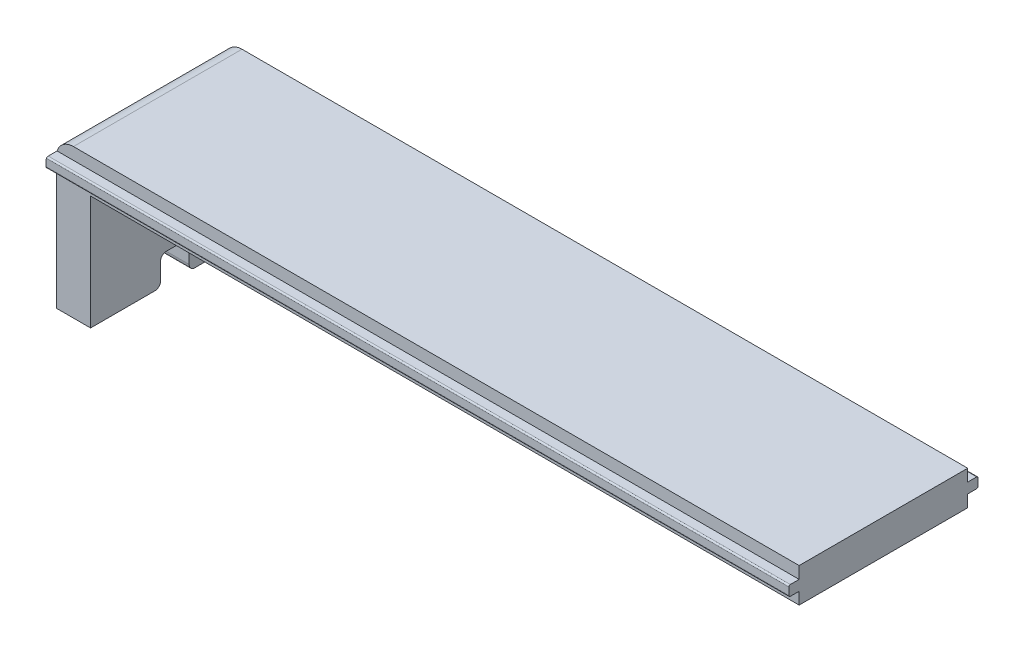
ISO-10303-21;
HEADER;
FILE_DESCRIPTION(('STEP AP214'),'2;1');
FILE_NAME('part.step','',(''),(''),'','','');
FILE_SCHEMA(('AUTOMOTIVE_DESIGN { 1 0 10303 214 1 1 1 1 }'));
ENDSEC;
DATA;
#1=APPLICATION_CONTEXT('core data for automotive mechanical design processes');
#2=APPLICATION_PROTOCOL_DEFINITION('international standard','automotive_design',2000,#1);
#3=PRODUCT_CONTEXT('',#1,'mechanical');
#4=PRODUCT('Part','Part','',(#3));
#5=PRODUCT_RELATED_PRODUCT_CATEGORY('part','',(#4));
#6=PRODUCT_DEFINITION_FORMATION('','',#4);
#7=PRODUCT_DEFINITION_CONTEXT('part definition',#1,'design');
#8=PRODUCT_DEFINITION('design','',#6,#7);
#9=PRODUCT_DEFINITION_SHAPE('','',#8);
#10=(LENGTH_UNIT() NAMED_UNIT(*) SI_UNIT(.MILLI.,.METRE.));
#11=(NAMED_UNIT(*) PLANE_ANGLE_UNIT() SI_UNIT($,.RADIAN.));
#12=(NAMED_UNIT(*) SI_UNIT($,.STERADIAN.) SOLID_ANGLE_UNIT());
#13=UNCERTAINTY_MEASURE_WITH_UNIT(LENGTH_MEASURE(1.E-05),#10,'distance_accuracy_value','');
#14=(GEOMETRIC_REPRESENTATION_CONTEXT(3) GLOBAL_UNCERTAINTY_ASSIGNED_CONTEXT((#13)) GLOBAL_UNIT_ASSIGNED_CONTEXT((#10,
#11,#12)) REPRESENTATION_CONTEXT('',''));
#15=CARTESIAN_POINT('',(0.,0.,0.));
#16=DIRECTION('',(0.,0.,1.));
#17=DIRECTION('',(1.,0.,0.));
#18=AXIS2_PLACEMENT_3D('',#15,#16,#17);
#19=CARTESIAN_POINT('',(0.,0.,29.5));
#20=DIRECTION('',(0.,0.,-1.));
#21=DIRECTION('',(-1.,0.,0.));
#22=AXIS2_PLACEMENT_3D('',#19,#20,#21);
#23=PLANE('',#22);
#24=DIRECTION('',(-1.,0.,0.));
#25=VECTOR('',#24,1.);
#26=CARTESIAN_POINT('',(0.,26.,29.5));
#27=LINE('',#26,#25);
#28=CARTESIAN_POINT('',(130.,26.,29.5));
#29=VERTEX_POINT('',#28);
#30=CARTESIAN_POINT('',(3.,26.,29.5));
#31=VERTEX_POINT('',#30);
#32=EDGE_CURVE('E321',#29,#31,#27,.T.);
#33=ORIENTED_EDGE('',*,*,#32,.T.);
#34=CARTESIAN_POINT('',(3.,23.,29.5));
#35=DIRECTION('',(0.,0.,-1.));
#36=DIRECTION('',(-1.,0.,0.));
#37=AXIS2_PLACEMENT_3D('',#34,#35,#36);
#38=CIRCLE('',#37,3.);
#39=CARTESIAN_POINT('',(0.13818239574917,23.9,29.5));
#40=VERTEX_POINT('',#39);
#41=EDGE_CURVE('E381',#31,#40,#38,.F.);
#42=ORIENTED_EDGE('',*,*,#41,.T.);
#43=DIRECTION('',(-1.,0.,0.));
#44=VECTOR('',#43,1.);
#45=CARTESIAN_POINT('',(132.545584412272,23.9,29.5));
#46=LINE('',#45,#44);
#47=CARTESIAN_POINT('',(130.,23.9,29.5));
#48=VERTEX_POINT('',#47);
#49=EDGE_CURVE('E622',#48,#40,#46,.T.);
#50=ORIENTED_EDGE('',*,*,#49,.F.);
#51=DIRECTION('',(0.,1.,0.));
#52=VECTOR('',#51,1.);
#53=CARTESIAN_POINT('',(130.,26.,29.5));
#54=LINE('',#53,#52);
#55=EDGE_CURVE('E316',#48,#29,#54,.T.);
#56=ORIENTED_EDGE('',*,*,#55,.T.);
#57=EDGE_LOOP('',(#33,#42,#50,#56));
#58=FACE_BOUND('',#57,.T.);
#59=ADVANCED_FACE('F53',(#58),#23,.F.);
#60=CARTESIAN_POINT('',(0.,0.,0.));
#61=DIRECTION('',(0.,0.,-1.));
#62=DIRECTION('',(-1.,0.,0.));
#63=AXIS2_PLACEMENT_3D('',#60,#61,#62);
#64=PLANE('',#63);
#65=DIRECTION('',(-1.,0.,0.));
#66=VECTOR('',#65,1.);
#67=CARTESIAN_POINT('',(132.545584412272,23.9,0.));
#68=LINE('',#67,#66);
#69=CARTESIAN_POINT('',(130.,23.9,0.));
#70=VERTEX_POINT('',#69);
#71=CARTESIAN_POINT('',(0.138182395749162,23.9,0.));
#72=VERTEX_POINT('',#71);
#73=EDGE_CURVE('E260',#70,#72,#68,.T.);
#74=ORIENTED_EDGE('',*,*,#73,.T.);
#75=CARTESIAN_POINT('',(3.,23.,0.));
#76=DIRECTION('',(0.,0.,-1.));
#77=DIRECTION('',(-1.,0.,0.));
#78=AXIS2_PLACEMENT_3D('',#75,#76,#77);
#79=CIRCLE('',#78,3.);
#80=CARTESIAN_POINT('',(3.,26.,0.));
#81=VERTEX_POINT('',#80);
#82=EDGE_CURVE('E375',#72,#81,#79,.T.);
#83=ORIENTED_EDGE('',*,*,#82,.T.);
#84=DIRECTION('',(-1.,0.,0.));
#85=VECTOR('',#84,1.);
#86=CARTESIAN_POINT('',(0.,26.,0.));
#87=LINE('',#86,#85);
#88=CARTESIAN_POINT('',(130.,26.,0.));
#89=VERTEX_POINT('',#88);
#90=EDGE_CURVE('E273',#89,#81,#87,.T.);
#91=ORIENTED_EDGE('',*,*,#90,.F.);
#92=DIRECTION('',(0.,1.,0.));
#93=VECTOR('',#92,1.);
#94=CARTESIAN_POINT('',(130.,26.,0.));
#95=LINE('',#94,#93);
#96=EDGE_CURVE('E337',#70,#89,#95,.T.);
#97=ORIENTED_EDGE('',*,*,#96,.F.);
#98=EDGE_LOOP('',(#74,#83,#91,#97));
#99=FACE_BOUND('',#98,.T.);
#100=ADVANCED_FACE('F587',(#99),#64,.T.);
#101=CARTESIAN_POINT('',(6.,0.,29.5));
#102=DIRECTION('',(0.,1.,0.));
#103=DIRECTION('',(-1.,0.,0.));
#104=AXIS2_PLACEMENT_3D('',#101,#102,#103);
#105=PLANE('',#104);
#106=DIRECTION('',(0.,0.,-1.));
#107=VECTOR('',#106,1.);
#108=CARTESIAN_POINT('',(0.,0.,29.5));
#109=LINE('',#108,#107);
#110=CARTESIAN_POINT('',(0.,0.,29.5));
#111=VERTEX_POINT('',#110);
#112=CARTESIAN_POINT('',(0.,0.,18.25));
#113=VERTEX_POINT('',#112);
#114=EDGE_CURVE('E344',#111,#113,#109,.T.);
#115=ORIENTED_EDGE('',*,*,#114,.T.);
#116=DIRECTION('',(-1.,0.,0.));
#117=VECTOR('',#116,1.);
#118=CARTESIAN_POINT('',(6.,0.,18.25));
#119=LINE('',#118,#117);
#120=CARTESIAN_POINT('',(6.,0.,18.25));
#121=VERTEX_POINT('',#120);
#122=EDGE_CURVE('E435',#113,#121,#119,.F.);
#123=ORIENTED_EDGE('',*,*,#122,.T.);
#124=DIRECTION('',(0.,0.,-1.));
#125=VECTOR('',#124,1.);
#126=CARTESIAN_POINT('',(6.,0.,29.5));
#127=LINE('',#126,#125);
#128=CARTESIAN_POINT('',(6.,0.,29.5));
#129=VERTEX_POINT('',#128);
#130=EDGE_CURVE('E361',#129,#121,#127,.T.);
#131=ORIENTED_EDGE('',*,*,#130,.F.);
#132=DIRECTION('',(1.,0.,0.));
#133=VECTOR('',#132,1.);
#134=CARTESIAN_POINT('',(6.,0.,29.5));
#135=LINE('',#134,#133);
#136=EDGE_CURVE('E272',#111,#129,#135,.T.);
#137=ORIENTED_EDGE('',*,*,#136,.F.);
#138=EDGE_LOOP('',(#115,#123,#131,#137));
#139=FACE_BOUND('',#138,.T.);
#140=ADVANCED_FACE('F595',(#139),#105,.F.);
#141=CARTESIAN_POINT('',(6.,0.,11.25));
#142=VERTEX_POINT('',#141);
#143=CARTESIAN_POINT('',(6.,0.,0.));
#144=VERTEX_POINT('',#143);
#145=EDGE_CURVE('E360',#142,#144,#127,.T.);
#146=ORIENTED_EDGE('',*,*,#145,.F.);
#147=DIRECTION('',(-1.,0.,0.));
#148=VECTOR('',#147,1.);
#149=CARTESIAN_POINT('',(6.,0.,11.25));
#150=LINE('',#149,#148);
#151=CARTESIAN_POINT('',(0.,0.,11.25));
#152=VERTEX_POINT('',#151);
#153=EDGE_CURVE('E444',#142,#152,#150,.T.);
#154=ORIENTED_EDGE('',*,*,#153,.T.);
#155=CARTESIAN_POINT('',(0.,0.,0.));
#156=VERTEX_POINT('',#155);
#157=EDGE_CURVE('E328',#152,#156,#109,.T.);
#158=ORIENTED_EDGE('',*,*,#157,.T.);
#159=DIRECTION('',(1.,0.,0.));
#160=VECTOR('',#159,1.);
#161=CARTESIAN_POINT('',(6.,0.,0.));
#162=LINE('',#161,#160);
#163=EDGE_CURVE('E270',#156,#144,#162,.T.);
#164=ORIENTED_EDGE('',*,*,#163,.T.);
#165=EDGE_LOOP('',(#146,#154,#158,#164));
#166=FACE_BOUND('',#165,.T.);
#167=ADVANCED_FACE('F533',(#166),#105,.F.);
#168=CARTESIAN_POINT('',(6.00000000000001,20.,29.5));
#169=DIRECTION('',(-1.,0.,0.));
#170=DIRECTION('',(0.,-1.,0.));
#171=AXIS2_PLACEMENT_3D('',#168,#169,#170);
#172=PLANE('',#171);
#173=ORIENTED_EDGE('',*,*,#130,.T.);
#174=CARTESIAN_POINT('',(6.00000000000001,1.,18.25));
#175=DIRECTION('',(-1.,0.,0.));
#176=DIRECTION('',(0.,-1.,0.));
#177=AXIS2_PLACEMENT_3D('',#174,#175,#176);
#178=CIRCLE('',#177,1.);
#179=CARTESIAN_POINT('',(6.00000000000001,1.,17.25));
#180=VERTEX_POINT('',#179);
#181=EDGE_CURVE('E441',#121,#180,#178,.F.);
#182=ORIENTED_EDGE('',*,*,#181,.T.);
#183=DIRECTION('',(0.,-1.,0.));
#184=VECTOR('',#183,1.);
#185=CARTESIAN_POINT('',(6.00000000000001,0.,17.25));
#186=LINE('',#185,#184);
#187=CARTESIAN_POINT('',(6.00000000000001,4.,17.25));
#188=VERTEX_POINT('',#187);
#189=EDGE_CURVE('E299',#188,#180,#186,.T.);
#190=ORIENTED_EDGE('',*,*,#189,.F.);
#191=CARTESIAN_POINT('',(6.00000000000001,4.,16.25));
#192=DIRECTION('',(-1.,0.,0.));
#193=DIRECTION('',(0.,-1.,0.));
#194=AXIS2_PLACEMENT_3D('',#191,#192,#193);
#195=CIRCLE('',#194,1.);
#196=CARTESIAN_POINT('',(6.00000000000001,5.,16.25));
#197=VERTEX_POINT('',#196);
#198=EDGE_CURVE('E450',#188,#197,#195,.T.);
#199=ORIENTED_EDGE('',*,*,#198,.T.);
#200=DIRECTION('',(0.,0.,1.));
#201=VECTOR('',#200,1.);
#202=CARTESIAN_POINT('',(6.00000000000001,5.,17.25));
#203=LINE('',#202,#201);
#204=CARTESIAN_POINT('',(6.00000000000001,5.,13.25));
#205=VERTEX_POINT('',#204);
#206=EDGE_CURVE('E303',#205,#197,#203,.T.);
#207=ORIENTED_EDGE('',*,*,#206,.F.);
#208=CARTESIAN_POINT('',(6.00000000000001,4.,13.25));
#209=DIRECTION('',(-1.,0.,0.));
#210=DIRECTION('',(0.,-1.,0.));
#211=AXIS2_PLACEMENT_3D('',#208,#209,#210);
#212=CIRCLE('',#211,1.);
#213=CARTESIAN_POINT('',(6.00000000000001,4.,12.25));
#214=VERTEX_POINT('',#213);
#215=EDGE_CURVE('E447',#205,#214,#212,.T.);
#216=ORIENTED_EDGE('',*,*,#215,.T.);
#217=DIRECTION('',(0.,1.,0.));
#218=VECTOR('',#217,1.);
#219=CARTESIAN_POINT('',(6.00000000000001,0.,12.25));
#220=LINE('',#219,#218);
#221=CARTESIAN_POINT('',(6.00000000000001,1.,12.25));
#222=VERTEX_POINT('',#221);
#223=EDGE_CURVE('E295',#222,#214,#220,.T.);
#224=ORIENTED_EDGE('',*,*,#223,.F.);
#225=CARTESIAN_POINT('',(6.,1.,11.25));
#226=DIRECTION('',(-1.,0.,0.));
#227=DIRECTION('',(0.,-1.,0.));
#228=AXIS2_PLACEMENT_3D('',#225,#226,#227);
#229=CIRCLE('',#228,1.);
#230=EDGE_CURVE('E438',#222,#142,#229,.F.);
#231=ORIENTED_EDGE('',*,*,#230,.T.);
#232=ORIENTED_EDGE('',*,*,#145,.T.);
#233=DIRECTION('',(0.,1.,0.));
#234=VECTOR('',#233,1.);
#235=CARTESIAN_POINT('',(6.00000000000001,20.,0.));
#236=LINE('',#235,#234);
#237=CARTESIAN_POINT('',(6.00000000000001,20.,0.));
#238=VERTEX_POINT('',#237);
#239=EDGE_CURVE('E331',#144,#238,#236,.T.);
#240=ORIENTED_EDGE('',*,*,#239,.T.);
#241=DIRECTION('',(0.,0.,-1.));
#242=VECTOR('',#241,1.);
#243=CARTESIAN_POINT('',(6.00000000000001,20.,29.5));
#244=LINE('',#243,#242);
#245=CARTESIAN_POINT('',(6.00000000000001,20.,29.5));
#246=VERTEX_POINT('',#245);
#247=EDGE_CURVE('E356',#246,#238,#244,.T.);
#248=ORIENTED_EDGE('',*,*,#247,.F.);
#249=DIRECTION('',(0.,1.,0.));
#250=VECTOR('',#249,1.);
#251=CARTESIAN_POINT('',(6.00000000000001,20.,29.5));
#252=LINE('',#251,#250);
#253=EDGE_CURVE('E310',#129,#246,#252,.T.);
#254=ORIENTED_EDGE('',*,*,#253,.F.);
#255=EDGE_LOOP('',(#173,#182,#190,#199,#207,#216,#224,#231,#232,#240,#248,#254));
#256=FACE_BOUND('',#255,.T.);
#257=ADVANCED_FACE('F855',(#256),#172,.F.);
#258=CARTESIAN_POINT('',(130.,20.,29.5));
#259=DIRECTION('',(0.,1.,0.));
#260=DIRECTION('',(-1.,0.,0.));
#261=AXIS2_PLACEMENT_3D('',#258,#259,#260);
#262=PLANE('',#261);
#263=DIRECTION('',(1.,0.,0.));
#264=VECTOR('',#263,1.);
#265=CARTESIAN_POINT('',(130.,20.,0.));
#266=LINE('',#265,#264);
#267=CARTESIAN_POINT('',(130.,20.,0.));
#268=VERTEX_POINT('',#267);
#269=EDGE_CURVE('E334',#238,#268,#266,.T.);
#270=ORIENTED_EDGE('',*,*,#269,.T.);
#271=DIRECTION('',(0.,0.,-1.));
#272=VECTOR('',#271,1.);
#273=CARTESIAN_POINT('',(130.,20.,29.5));
#274=LINE('',#273,#272);
#275=CARTESIAN_POINT('',(130.,20.,29.5));
#276=VERTEX_POINT('',#275);
#277=EDGE_CURVE('E352',#276,#268,#274,.T.);
#278=ORIENTED_EDGE('',*,*,#277,.F.);
#279=DIRECTION('',(1.,0.,0.));
#280=VECTOR('',#279,1.);
#281=CARTESIAN_POINT('',(130.,20.,29.5));
#282=LINE('',#281,#280);
#283=EDGE_CURVE('E313',#246,#276,#282,.T.);
#284=ORIENTED_EDGE('',*,*,#283,.F.);
#285=ORIENTED_EDGE('',*,*,#247,.T.);
#286=EDGE_LOOP('',(#270,#278,#284,#285));
#287=FACE_BOUND('',#286,.T.);
#288=ADVANCED_FACE('F892',(#287),#262,.F.);
#289=CARTESIAN_POINT('',(130.,26.,29.5));
#290=DIRECTION('',(-1.,0.,0.));
#291=DIRECTION('',(0.,0.,1.));
#292=AXIS2_PLACEMENT_3D('',#289,#290,#291);
#293=PLANE('',#292);
#294=DIRECTION('',(0.,-1.,0.));
#295=VECTOR('',#294,1.);
#296=CARTESIAN_POINT('',(130.,23.9,31.3));
#297=LINE('',#296,#295);
#298=CARTESIAN_POINT('',(130.,23.65,31.3));
#299=VERTEX_POINT('',#298);
#300=CARTESIAN_POINT('',(130.,22.35,31.3));
#301=VERTEX_POINT('',#300);
#302=EDGE_CURVE('E631',#299,#301,#297,.T.);
#303=ORIENTED_EDGE('',*,*,#302,.T.);
#304=CARTESIAN_POINT('',(130.,22.35,31.05));
#305=DIRECTION('',(-1.,0.,0.));
#306=DIRECTION('',(0.,0.,1.));
#307=AXIS2_PLACEMENT_3D('',#304,#305,#306);
#308=CIRCLE('',#307,0.25);
#309=CARTESIAN_POINT('',(130.,22.1,31.05));
#310=VERTEX_POINT('',#309);
#311=EDGE_CURVE('E510',#301,#310,#308,.F.);
#312=ORIENTED_EDGE('',*,*,#311,.T.);
#313=DIRECTION('',(0.,0.,-1.));
#314=VECTOR('',#313,1.);
#315=CARTESIAN_POINT('',(130.,22.1,29.5));
#316=LINE('',#315,#314);
#317=CARTESIAN_POINT('',(130.,22.1,29.5));
#318=VERTEX_POINT('',#317);
#319=EDGE_CURVE('E485',#310,#318,#316,.T.);
#320=ORIENTED_EDGE('',*,*,#319,.T.);
#321=EDGE_CURVE('E317',#276,#318,#54,.T.);
#322=ORIENTED_EDGE('',*,*,#321,.F.);
#323=ORIENTED_EDGE('',*,*,#277,.T.);
#324=CARTESIAN_POINT('',(130.,22.1,0.));
#325=VERTEX_POINT('',#324);
#326=EDGE_CURVE('E338',#268,#325,#95,.T.);
#327=ORIENTED_EDGE('',*,*,#326,.T.);
#328=DIRECTION('',(0.,0.,-1.));
#329=VECTOR('',#328,1.);
#330=CARTESIAN_POINT('',(130.,22.1,0.));
#331=LINE('',#330,#329);
#332=CARTESIAN_POINT('',(130.,22.1,-1.55));
#333=VERTEX_POINT('',#332);
#334=EDGE_CURVE('E278',#325,#333,#331,.T.);
#335=ORIENTED_EDGE('',*,*,#334,.T.);
#336=CARTESIAN_POINT('',(130.,22.35,-1.55));
#337=DIRECTION('',(-1.,0.,0.));
#338=DIRECTION('',(0.,0.,1.));
#339=AXIS2_PLACEMENT_3D('',#336,#337,#338);
#340=CIRCLE('',#339,0.25);
#341=CARTESIAN_POINT('',(130.,22.35,-1.8));
#342=VERTEX_POINT('',#341);
#343=EDGE_CURVE('E504',#333,#342,#340,.F.);
#344=ORIENTED_EDGE('',*,*,#343,.T.);
#345=DIRECTION('',(0.,1.,0.));
#346=VECTOR('',#345,1.);
#347=CARTESIAN_POINT('',(130.,23.9,-1.8));
#348=LINE('',#347,#346);
#349=CARTESIAN_POINT('',(130.,23.65,-1.8));
#350=VERTEX_POINT('',#349);
#351=EDGE_CURVE('E280',#342,#350,#348,.T.);
#352=ORIENTED_EDGE('',*,*,#351,.T.);
#353=CARTESIAN_POINT('',(130.,23.65,-1.55));
#354=DIRECTION('',(-1.,0.,0.));
#355=DIRECTION('',(0.,0.,1.));
#356=AXIS2_PLACEMENT_3D('',#353,#354,#355);
#357=CIRCLE('',#356,0.25);
#358=CARTESIAN_POINT('',(130.,23.9,-1.55));
#359=VERTEX_POINT('',#358);
#360=EDGE_CURVE('E501',#350,#359,#357,.F.);
#361=ORIENTED_EDGE('',*,*,#360,.T.);
#362=DIRECTION('',(0.,0.,1.));
#363=VECTOR('',#362,1.);
#364=CARTESIAN_POINT('',(130.,23.9,0.));
#365=LINE('',#364,#363);
#366=EDGE_CURVE('E292',#359,#70,#365,.T.);
#367=ORIENTED_EDGE('',*,*,#366,.T.);
#368=ORIENTED_EDGE('',*,*,#96,.T.);
#369=DIRECTION('',(0.,0.,-1.));
#370=VECTOR('',#369,1.);
#371=CARTESIAN_POINT('',(130.,26.,29.5));
#372=LINE('',#371,#370);
#373=EDGE_CURVE('E348',#29,#89,#372,.T.);
#374=ORIENTED_EDGE('',*,*,#373,.F.);
#375=ORIENTED_EDGE('',*,*,#55,.F.);
#376=DIRECTION('',(0.,0.,1.));
#377=VECTOR('',#376,1.);
#378=CARTESIAN_POINT('',(130.,23.9,29.5));
#379=LINE('',#378,#377);
#380=CARTESIAN_POINT('',(130.,23.9,31.05));
#381=VERTEX_POINT('',#380);
#382=EDGE_CURVE('E637',#48,#381,#379,.T.);
#383=ORIENTED_EDGE('',*,*,#382,.T.);
#384=CARTESIAN_POINT('',(130.,23.65,31.05));
#385=DIRECTION('',(-1.,0.,0.));
#386=DIRECTION('',(0.,0.,1.));
#387=AXIS2_PLACEMENT_3D('',#384,#385,#386);
#388=CIRCLE('',#387,0.25);
#389=EDGE_CURVE('E507',#381,#299,#388,.F.);
#390=ORIENTED_EDGE('',*,*,#389,.T.);
#391=EDGE_LOOP('',(#303,#312,#320,#322,#323,#327,#335,#344,#352,#361,#367,#368,#374,#375,#383,#390));
#392=FACE_BOUND('',#391,.T.);
#393=ADVANCED_FACE('F842',(#392),#293,.F.);
#394=CARTESIAN_POINT('',(0.,26.,29.5));
#395=DIRECTION('',(0.,-1.,0.));
#396=DIRECTION('',(0.,0.,-1.));
#397=AXIS2_PLACEMENT_3D('',#394,#395,#396);
#398=PLANE('',#397);
#399=ORIENTED_EDGE('',*,*,#90,.T.);
#400=DIRECTION('',(0.,0.,-1.));
#401=VECTOR('',#400,1.);
#402=CARTESIAN_POINT('',(3.,26.,29.5));
#403=LINE('',#402,#401);
#404=EDGE_CURVE('E378',#81,#31,#403,.F.);
#405=ORIENTED_EDGE('',*,*,#404,.T.);
#406=ORIENTED_EDGE('',*,*,#32,.F.);
#407=ORIENTED_EDGE('',*,*,#373,.T.);
#408=EDGE_LOOP('',(#399,#405,#406,#407));
#409=FACE_BOUND('',#408,.T.);
#410=ADVANCED_FACE('F606',(#409),#398,.F.);
#411=CARTESIAN_POINT('',(0.,0.,29.5));
#412=DIRECTION('',(1.,0.,0.));
#413=DIRECTION('',(0.,0.,-1.));
#414=AXIS2_PLACEMENT_3D('',#411,#412,#413);
#415=PLANE('',#414);
#416=DIRECTION('',(0.,0.,1.));
#417=VECTOR('',#416,1.);
#418=CARTESIAN_POINT('',(0.,22.1,29.5));
#419=LINE('',#418,#417);
#420=CARTESIAN_POINT('',(0.,22.1,29.5));
#421=VERTEX_POINT('',#420);
#422=CARTESIAN_POINT('',(0.,22.1,31.05));
#423=VERTEX_POINT('',#422);
#424=EDGE_CURVE('E619',#421,#423,#419,.T.);
#425=ORIENTED_EDGE('',*,*,#424,.T.);
#426=CARTESIAN_POINT('',(0.,22.35,31.05));
#427=DIRECTION('',(1.,0.,0.));
#428=DIRECTION('',(0.,0.,-1.));
#429=AXIS2_PLACEMENT_3D('',#426,#427,#428);
#430=CIRCLE('',#429,0.25);
#431=CARTESIAN_POINT('',(0.,22.35,31.3));
#432=VERTEX_POINT('',#431);
#433=EDGE_CURVE('E491',#423,#432,#430,.F.);
#434=ORIENTED_EDGE('',*,*,#433,.T.);
#435=DIRECTION('',(0.,1.,0.));
#436=VECTOR('',#435,1.);
#437=CARTESIAN_POINT('',(0.,23.9,31.3));
#438=LINE('',#437,#436);
#439=CARTESIAN_POINT('',(0.,23.,31.3));
#440=VERTEX_POINT('',#439);
#441=EDGE_CURVE('E621',#432,#440,#438,.T.);
#442=ORIENTED_EDGE('',*,*,#441,.T.);
#443=DIRECTION('',(0.,0.,-1.));
#444=VECTOR('',#443,1.);
#445=CARTESIAN_POINT('',(0.,23.,29.5));
#446=LINE('',#445,#444);
#447=CARTESIAN_POINT('',(0.,23.,-1.8));
#448=VERTEX_POINT('',#447);
#449=EDGE_CURVE('E365',#440,#448,#446,.T.);
#450=ORIENTED_EDGE('',*,*,#449,.T.);
#451=DIRECTION('',(0.,-1.,0.));
#452=VECTOR('',#451,1.);
#453=CARTESIAN_POINT('',(0.,23.9,-1.8));
#454=LINE('',#453,#452);
#455=CARTESIAN_POINT('',(0.,22.35,-1.8));
#456=VERTEX_POINT('',#455);
#457=EDGE_CURVE('E261',#448,#456,#454,.T.);
#458=ORIENTED_EDGE('',*,*,#457,.T.);
#459=CARTESIAN_POINT('',(0.,22.35,-1.55));
#460=DIRECTION('',(1.,0.,0.));
#461=DIRECTION('',(0.,0.,-1.));
#462=AXIS2_PLACEMENT_3D('',#459,#460,#461);
#463=CIRCLE('',#462,0.25);
#464=CARTESIAN_POINT('',(0.,22.1,-1.55));
#465=VERTEX_POINT('',#464);
#466=EDGE_CURVE('E255',#456,#465,#463,.F.);
#467=ORIENTED_EDGE('',*,*,#466,.T.);
#468=DIRECTION('',(0.,0.,1.));
#469=VECTOR('',#468,1.);
#470=CARTESIAN_POINT('',(0.,22.1,0.));
#471=LINE('',#470,#469);
#472=CARTESIAN_POINT('',(0.,22.1,0.));
#473=VERTEX_POINT('',#472);
#474=EDGE_CURVE('E247',#465,#473,#471,.T.);
#475=ORIENTED_EDGE('',*,*,#474,.T.);
#476=DIRECTION('',(0.,-1.,0.));
#477=VECTOR('',#476,1.);
#478=CARTESIAN_POINT('',(0.,0.,0.));
#479=LINE('',#478,#477);
#480=EDGE_CURVE('E252',#473,#156,#479,.T.);
#481=ORIENTED_EDGE('',*,*,#480,.T.);
#482=ORIENTED_EDGE('',*,*,#157,.F.);
#483=DIRECTION('',(0.,-1.,0.));
#484=VECTOR('',#483,1.);
#485=CARTESIAN_POINT('',(0.,0.,11.25));
#486=LINE('',#485,#484);
#487=CARTESIAN_POINT('',(0.,4.,11.25));
#488=VERTEX_POINT('',#487);
#489=EDGE_CURVE('E414',#152,#488,#486,.F.);
#490=ORIENTED_EDGE('',*,*,#489,.T.);
#491=CARTESIAN_POINT('',(0.,4.,13.25));
#492=DIRECTION('',(1.,0.,0.));
#493=DIRECTION('',(0.,0.,-1.));
#494=AXIS2_PLACEMENT_3D('',#491,#492,#493);
#495=CIRCLE('',#494,2.);
#496=CARTESIAN_POINT('',(0.,6.,13.25));
#497=VERTEX_POINT('',#496);
#498=EDGE_CURVE('E410',#497,#488,#495,.F.);
#499=ORIENTED_EDGE('',*,*,#498,.F.);
#500=DIRECTION('',(0.,0.,-1.));
#501=VECTOR('',#500,1.);
#502=CARTESIAN_POINT('',(0.,6.,29.5));
#503=LINE('',#502,#501);
#504=CARTESIAN_POINT('',(0.,6.,16.25));
#505=VERTEX_POINT('',#504);
#506=EDGE_CURVE('E407',#497,#505,#503,.F.);
#507=ORIENTED_EDGE('',*,*,#506,.T.);
#508=CARTESIAN_POINT('',(0.,4.,16.25));
#509=DIRECTION('',(1.,0.,0.));
#510=DIRECTION('',(0.,0.,-1.));
#511=AXIS2_PLACEMENT_3D('',#508,#509,#510);
#512=CIRCLE('',#511,2.);
#513=CARTESIAN_POINT('',(0.,4.,18.25));
#514=VERTEX_POINT('',#513);
#515=EDGE_CURVE('E403',#514,#505,#512,.F.);
#516=ORIENTED_EDGE('',*,*,#515,.F.);
#517=DIRECTION('',(0.,1.,0.));
#518=VECTOR('',#517,1.);
#519=CARTESIAN_POINT('',(0.,0.,18.25));
#520=LINE('',#519,#518);
#521=EDGE_CURVE('E400',#514,#113,#520,.F.);
#522=ORIENTED_EDGE('',*,*,#521,.T.);
#523=ORIENTED_EDGE('',*,*,#114,.F.);
#524=DIRECTION('',(0.,-1.,0.));
#525=VECTOR('',#524,1.);
#526=CARTESIAN_POINT('',(0.,0.,29.5));
#527=LINE('',#526,#525);
#528=EDGE_CURVE('E325',#421,#111,#527,.T.);
#529=ORIENTED_EDGE('',*,*,#528,.F.);
#530=EDGE_LOOP('',(#425,#434,#442,#450,#458,#467,#475,#481,#482,#490,#499,#507,#516,#522,#523,#529));
#531=FACE_BOUND('',#530,.T.);
#532=ADVANCED_FACE('F250',(#531),#415,.F.);
#533=ORIENTED_EDGE('',*,*,#321,.T.);
#534=DIRECTION('',(-1.,0.,0.));
#535=VECTOR('',#534,1.);
#536=CARTESIAN_POINT('',(132.545584412272,22.1,29.5));
#537=LINE('',#536,#535);
#538=EDGE_CURVE('E610',#318,#421,#537,.T.);
#539=ORIENTED_EDGE('',*,*,#538,.T.);
#540=ORIENTED_EDGE('',*,*,#528,.T.);
#541=ORIENTED_EDGE('',*,*,#136,.T.);
#542=ORIENTED_EDGE('',*,*,#253,.T.);
#543=ORIENTED_EDGE('',*,*,#283,.T.);
#544=EDGE_LOOP('',(#533,#539,#540,#541,#542,#543));
#545=FACE_BOUND('',#544,.T.);
#546=ADVANCED_FACE('F590',(#545),#23,.F.);
#547=DIRECTION('',(-1.,0.,0.));
#548=VECTOR('',#547,1.);
#549=CARTESIAN_POINT('',(132.545584412272,22.1,0.));
#550=LINE('',#549,#548);
#551=EDGE_CURVE('E266',#325,#473,#550,.T.);
#552=ORIENTED_EDGE('',*,*,#551,.F.);
#553=ORIENTED_EDGE('',*,*,#326,.F.);
#554=ORIENTED_EDGE('',*,*,#269,.F.);
#555=ORIENTED_EDGE('',*,*,#239,.F.);
#556=ORIENTED_EDGE('',*,*,#163,.F.);
#557=ORIENTED_EDGE('',*,*,#480,.F.);
#558=EDGE_LOOP('',(#552,#553,#554,#555,#556,#557));
#559=FACE_BOUND('',#558,.T.);
#560=ADVANCED_FACE('F264',(#559),#64,.T.);
#561=CARTESIAN_POINT('',(130.001,0.,17.25));
#562=DIRECTION('',(0.,0.,1.));
#563=DIRECTION('',(0.,-1.,0.));
#564=AXIS2_PLACEMENT_3D('',#561,#562,#563);
#565=PLANE('',#564);
#566=ORIENTED_EDGE('',*,*,#189,.T.);
#567=DIRECTION('',(-1.,0.,0.));
#568=VECTOR('',#567,1.);
#569=CARTESIAN_POINT('',(130.001,1.00000000000001,17.25));
#570=LINE('',#569,#568);
#571=CARTESIAN_POINT('',(1.,1.,17.25));
#572=VERTEX_POINT('',#571);
#573=EDGE_CURVE('E432',#180,#572,#570,.T.);
#574=ORIENTED_EDGE('',*,*,#573,.T.);
#575=DIRECTION('',(0.,1.,0.));
#576=VECTOR('',#575,1.);
#577=CARTESIAN_POINT('',(1.,0.,17.25));
#578=LINE('',#577,#576);
#579=CARTESIAN_POINT('',(1.,4.,17.25));
#580=VERTEX_POINT('',#579);
#581=EDGE_CURVE('E429',#572,#580,#578,.T.);
#582=ORIENTED_EDGE('',*,*,#581,.T.);
#583=DIRECTION('',(-1.,0.,0.));
#584=VECTOR('',#583,1.);
#585=CARTESIAN_POINT('',(6.00000000000001,4.,17.25));
#586=LINE('',#585,#584);
#587=EDGE_CURVE('E426',#580,#188,#586,.F.);
#588=ORIENTED_EDGE('',*,*,#587,.T.);
#589=EDGE_LOOP('',(#566,#574,#582,#588));
#590=FACE_BOUND('',#589,.T.);
#591=ADVANCED_FACE('F604',(#590),#565,.F.);
#592=CARTESIAN_POINT('',(130.001,0.,12.25));
#593=DIRECTION('',(0.,0.,-1.));
#594=DIRECTION('',(0.,1.,0.));
#595=AXIS2_PLACEMENT_3D('',#592,#593,#594);
#596=PLANE('',#595);
#597=DIRECTION('',(0.,-1.,0.));
#598=VECTOR('',#597,1.);
#599=CARTESIAN_POINT('',(1.,0.,12.25));
#600=LINE('',#599,#598);
#601=CARTESIAN_POINT('',(1.,4.,12.25));
#602=VERTEX_POINT('',#601);
#603=CARTESIAN_POINT('',(1.,1.,12.25));
#604=VERTEX_POINT('',#603);
#605=EDGE_CURVE('E393',#602,#604,#600,.T.);
#606=ORIENTED_EDGE('',*,*,#605,.T.);
#607=DIRECTION('',(-1.,0.,0.));
#608=VECTOR('',#607,1.);
#609=CARTESIAN_POINT('',(130.001,1.00000000000001,12.25));
#610=LINE('',#609,#608);
#611=EDGE_CURVE('E397',#604,#222,#610,.F.);
#612=ORIENTED_EDGE('',*,*,#611,.T.);
#613=ORIENTED_EDGE('',*,*,#223,.T.);
#614=DIRECTION('',(-1.,0.,0.));
#615=VECTOR('',#614,1.);
#616=CARTESIAN_POINT('',(0.,4.,12.25));
#617=LINE('',#616,#615);
#618=EDGE_CURVE('E390',#214,#602,#617,.T.);
#619=ORIENTED_EDGE('',*,*,#618,.T.);
#620=EDGE_LOOP('',(#606,#612,#613,#619));
#621=FACE_BOUND('',#620,.T.);
#622=ADVANCED_FACE('F879',(#621),#596,.F.);
#623=CARTESIAN_POINT('',(130.001,5.,17.25));
#624=DIRECTION('',(0.,1.,0.));
#625=DIRECTION('',(0.,0.,1.));
#626=AXIS2_PLACEMENT_3D('',#623,#624,#625);
#627=PLANE('',#626);
#628=DIRECTION('',(0.,0.,-1.));
#629=VECTOR('',#628,1.);
#630=CARTESIAN_POINT('',(1.,5.,17.25));
#631=LINE('',#630,#629);
#632=CARTESIAN_POINT('',(1.,5.,16.25));
#633=VERTEX_POINT('',#632);
#634=CARTESIAN_POINT('',(1.,5.,13.25));
#635=VERTEX_POINT('',#634);
#636=EDGE_CURVE('E420',#633,#635,#631,.T.);
#637=ORIENTED_EDGE('',*,*,#636,.T.);
#638=DIRECTION('',(-1.,0.,0.));
#639=VECTOR('',#638,1.);
#640=CARTESIAN_POINT('',(6.00000000000001,5.,13.25));
#641=LINE('',#640,#639);
#642=EDGE_CURVE('E423',#635,#205,#641,.F.);
#643=ORIENTED_EDGE('',*,*,#642,.T.);
#644=ORIENTED_EDGE('',*,*,#206,.T.);
#645=DIRECTION('',(-1.,0.,0.));
#646=VECTOR('',#645,1.);
#647=CARTESIAN_POINT('',(0.,5.,16.25));
#648=LINE('',#647,#646);
#649=EDGE_CURVE('E417',#197,#633,#648,.T.);
#650=ORIENTED_EDGE('',*,*,#649,.T.);
#651=EDGE_LOOP('',(#637,#643,#644,#650));
#652=FACE_BOUND('',#651,.T.);
#653=ADVANCED_FACE('F869',(#652),#627,.F.);
#654=CARTESIAN_POINT('',(132.545584412272,22.1,0.));
#655=DIRECTION('',(0.,-1.,0.));
#656=DIRECTION('',(0.,0.,-1.));
#657=AXIS2_PLACEMENT_3D('',#654,#655,#656);
#658=PLANE('',#657);
#659=ORIENTED_EDGE('',*,*,#474,.F.);
#660=DIRECTION('',(-1.,0.,0.));
#661=VECTOR('',#660,1.);
#662=CARTESIAN_POINT('',(132.545584412272,22.1,-1.55));
#663=LINE('',#662,#661);
#664=EDGE_CURVE('E63',#465,#333,#663,.F.);
#665=ORIENTED_EDGE('',*,*,#664,.T.);
#666=ORIENTED_EDGE('',*,*,#334,.F.);
#667=ORIENTED_EDGE('',*,*,#551,.T.);
#668=EDGE_LOOP('',(#659,#665,#666,#667));
#669=FACE_BOUND('',#668,.T.);
#670=ADVANCED_FACE('F276',(#669),#658,.T.);
#671=CARTESIAN_POINT('',(132.545584412272,23.9,-1.8));
#672=DIRECTION('',(0.,0.,-1.));
#673=DIRECTION('',(0.,1.,0.));
#674=AXIS2_PLACEMENT_3D('',#671,#672,#673);
#675=PLANE('',#674);
#676=ORIENTED_EDGE('',*,*,#351,.F.);
#677=DIRECTION('',(-1.,0.,0.));
#678=VECTOR('',#677,1.);
#679=CARTESIAN_POINT('',(132.545584412272,22.35,-1.8));
#680=LINE('',#679,#678);
#681=EDGE_CURVE('E656',#342,#456,#680,.T.);
#682=ORIENTED_EDGE('',*,*,#681,.T.);
#683=ORIENTED_EDGE('',*,*,#457,.F.);
#684=CARTESIAN_POINT('',(3.,23.,-1.8));
#685=DIRECTION('',(0.,0.,-1.));
#686=DIRECTION('',(0.,1.,0.));
#687=AXIS2_PLACEMENT_3D('',#684,#685,#686);
#688=CIRCLE('',#687,3.);
#689=CARTESIAN_POINT('',(0.0712630708785051,23.65,-1.8));
#690=VERTEX_POINT('',#689);
#691=EDGE_CURVE('E369',#448,#690,#688,.T.);
#692=ORIENTED_EDGE('',*,*,#691,.T.);
#693=DIRECTION('',(-1.,0.,0.));
#694=VECTOR('',#693,1.);
#695=CARTESIAN_POINT('',(132.545584412272,23.65,-1.8));
#696=LINE('',#695,#694);
#697=EDGE_CURVE('E658',#690,#350,#696,.F.);
#698=ORIENTED_EDGE('',*,*,#697,.T.);
#699=EDGE_LOOP('',(#676,#682,#683,#692,#698));
#700=FACE_BOUND('',#699,.T.);
#701=ADVANCED_FACE('F653',(#700),#675,.T.);
#702=CARTESIAN_POINT('',(132.545584412272,23.9,0.));
#703=DIRECTION('',(0.,1.,0.));
#704=DIRECTION('',(0.,0.,1.));
#705=AXIS2_PLACEMENT_3D('',#702,#703,#704);
#706=PLANE('',#705);
#707=ORIENTED_EDGE('',*,*,#366,.F.);
#708=DIRECTION('',(-1.,0.,0.));
#709=VECTOR('',#708,1.);
#710=CARTESIAN_POINT('',(132.545584412272,23.9,-1.55));
#711=LINE('',#710,#709);
#712=CARTESIAN_POINT('',(0.138182395749165,23.9,-1.55));
#713=VERTEX_POINT('',#712);
#714=EDGE_CURVE('E11',#359,#713,#711,.T.);
#715=ORIENTED_EDGE('',*,*,#714,.T.);
#716=DIRECTION('',(0.,0.,-1.));
#717=VECTOR('',#716,1.);
#718=CARTESIAN_POINT('',(0.138182395749165,23.9,-1.8));
#719=LINE('',#718,#717);
#720=EDGE_CURVE('E372',#713,#72,#719,.F.);
#721=ORIENTED_EDGE('',*,*,#720,.T.);
#722=ORIENTED_EDGE('',*,*,#73,.F.);
#723=EDGE_LOOP('',(#707,#715,#721,#722));
#724=FACE_BOUND('',#723,.T.);
#725=ADVANCED_FACE('F897',(#724),#706,.T.);
#726=CARTESIAN_POINT('',(132.545584412272,23.9,29.5));
#727=DIRECTION('',(0.,1.,0.));
#728=DIRECTION('',(0.,0.,1.));
#729=AXIS2_PLACEMENT_3D('',#726,#727,#728);
#730=PLANE('',#729);
#731=DIRECTION('',(0.,0.,-1.));
#732=VECTOR('',#731,1.);
#733=CARTESIAN_POINT('',(0.138182395749166,23.9,29.5));
#734=LINE('',#733,#732);
#735=CARTESIAN_POINT('',(0.138182395749166,23.9,31.05));
#736=VERTEX_POINT('',#735);
#737=EDGE_CURVE('E384',#40,#736,#734,.F.);
#738=ORIENTED_EDGE('',*,*,#737,.T.);
#739=DIRECTION('',(-1.,0.,0.));
#740=VECTOR('',#739,1.);
#741=CARTESIAN_POINT('',(132.545584412272,23.9,31.05));
#742=LINE('',#741,#740);
#743=EDGE_CURVE('E664',#736,#381,#742,.F.);
#744=ORIENTED_EDGE('',*,*,#743,.T.);
#745=ORIENTED_EDGE('',*,*,#382,.F.);
#746=ORIENTED_EDGE('',*,*,#49,.T.);
#747=EDGE_LOOP('',(#738,#744,#745,#746));
#748=FACE_BOUND('',#747,.T.);
#749=ADVANCED_FACE('F909',(#748),#730,.T.);
#750=CARTESIAN_POINT('',(132.545584412272,23.9,31.3));
#751=DIRECTION('',(0.,0.,1.));
#752=DIRECTION('',(1.,0.,0.));
#753=AXIS2_PLACEMENT_3D('',#750,#751,#752);
#754=PLANE('',#753);
#755=ORIENTED_EDGE('',*,*,#441,.F.);
#756=DIRECTION('',(-1.,0.,0.));
#757=VECTOR('',#756,1.);
#758=CARTESIAN_POINT('',(132.545584412272,22.35,31.3));
#759=LINE('',#758,#757);
#760=EDGE_CURVE('E498',#432,#301,#759,.F.);
#761=ORIENTED_EDGE('',*,*,#760,.T.);
#762=ORIENTED_EDGE('',*,*,#302,.F.);
#763=DIRECTION('',(-1.,0.,0.));
#764=VECTOR('',#763,1.);
#765=CARTESIAN_POINT('',(132.545584412272,23.65,31.3));
#766=LINE('',#765,#764);
#767=CARTESIAN_POINT('',(0.071263070878506,23.65,31.3));
#768=VERTEX_POINT('',#767);
#769=EDGE_CURVE('E494',#299,#768,#766,.T.);
#770=ORIENTED_EDGE('',*,*,#769,.T.);
#771=CARTESIAN_POINT('',(3.,23.,31.3));
#772=DIRECTION('',(0.,0.,1.));
#773=DIRECTION('',(1.,0.,0.));
#774=AXIS2_PLACEMENT_3D('',#771,#772,#773);
#775=CIRCLE('',#774,3.);
#776=EDGE_CURVE('E387',#768,#440,#775,.T.);
#777=ORIENTED_EDGE('',*,*,#776,.T.);
#778=EDGE_LOOP('',(#755,#761,#762,#770,#777));
#779=FACE_BOUND('',#778,.T.);
#780=ADVANCED_FACE('F912',(#779),#754,.T.);
#781=CARTESIAN_POINT('',(132.545584412272,22.1,29.5));
#782=DIRECTION('',(0.,-1.,0.));
#783=DIRECTION('',(0.,0.,-1.));
#784=AXIS2_PLACEMENT_3D('',#781,#782,#783);
#785=PLANE('',#784);
#786=ORIENTED_EDGE('',*,*,#319,.F.);
#787=DIRECTION('',(-1.,0.,0.));
#788=VECTOR('',#787,1.);
#789=CARTESIAN_POINT('',(132.545584412272,22.1,31.05));
#790=LINE('',#789,#788);
#791=EDGE_CURVE('E453',#310,#423,#790,.T.);
#792=ORIENTED_EDGE('',*,*,#791,.T.);
#793=ORIENTED_EDGE('',*,*,#424,.F.);
#794=ORIENTED_EDGE('',*,*,#538,.F.);
#795=EDGE_LOOP('',(#786,#792,#793,#794));
#796=FACE_BOUND('',#795,.T.);
#797=ADVANCED_FACE('F532',(#796),#785,.T.);
#798=CARTESIAN_POINT('',(3.,23.,29.5));
#799=DIRECTION('',(0.,0.,-1.));
#800=DIRECTION('',(-1.,0.,0.));
#801=AXIS2_PLACEMENT_3D('',#798,#799,#800);
#802=CYLINDRICAL_SURFACE('',#801,3.);
#803=ORIENTED_EDGE('',*,*,#776,.F.);
#804=CARTESIAN_POINT('',(0.071263070878506,23.65,31.3));
#805=CARTESIAN_POINT('',(0.0744690977444787,23.664464819486,31.3000097515422));
#806=CARTESIAN_POINT('',(0.0777890045808785,23.6788982045119,31.298745357496));
#807=CARTESIAN_POINT('',(0.084536271192432,23.7073030152854,31.2937679431263));
#808=CARTESIAN_POINT('',(0.0879635727590551,23.7212746831288,31.2900562281245));
#809=CARTESIAN_POINT('',(0.094809912555176,23.7483768666999,31.2802823221382));
#810=CARTESIAN_POINT('',(0.0982289483131281,23.7615071550876,31.2742194989804));
#811=CARTESIAN_POINT('',(0.104918453684456,23.7865561374686,31.2599056015671));
#812=CARTESIAN_POINT('',(0.108188941762222,23.798474982273,31.2516548001527));
#813=CARTESIAN_POINT('',(0.114427938133773,23.8207360239569,31.2331884589116));
#814=CARTESIAN_POINT('',(0.117396961192929,23.8310809240097,31.2229763573752));
#815=CARTESIAN_POINT('',(0.122887840672884,23.8498952318247,31.2008402090162));
#816=CARTESIAN_POINT('',(0.125409669491255,23.8583645238256,31.188916056602));
#817=CARTESIAN_POINT('',(0.129795984484565,23.8729176477495,31.1640579744863));
#818=CARTESIAN_POINT('',(0.13167740995476,23.8790635250238,31.1511633472729));
#819=CARTESIAN_POINT('',(0.134766684302614,23.8890814580654,31.124450650128));
#820=CARTESIAN_POINT('',(0.135975356372451,23.8929562930267,31.1106337320259));
#821=CARTESIAN_POINT('',(0.137264612051227,23.897077622884,31.0889081557701));
#822=CARTESIAN_POINT('',(0.137608227117859,23.8981727400773,31.0811663358346));
#823=CARTESIAN_POINT('',(0.1380671829366,23.8996336994185,31.0656177308079));
#824=CARTESIAN_POINT('',(0.13818282092074,23.9000004911473,31.0578110436506));
#825=CARTESIAN_POINT('',(0.138182395749117,23.9,31.05));
#826=B_SPLINE_CURVE_WITH_KNOTS('',3,(#804,#805,#806,#807,#808,#809,#810,#811,#812,#813,#814,
#815,#816,#817,#818,#819,#820,#821,#822,#823,#824,#825),.UNSPECIFIED.,.F.,.F.,(4,2,2,2,2,2,2,2,
2,2,4),(0.,0.0443849723156408,0.0887462902541493,0.13311954448225,0.177487267961553,
0.221777910339038,0.266071285542597,0.309080394084284,0.352036759623114,0.375482523117319,
0.398897698218099),.UNSPECIFIED.);
#827=EDGE_CURVE('E70',#768,#736,#826,.T.);
#828=ORIENTED_EDGE('',*,*,#827,.T.);
#829=ORIENTED_EDGE('',*,*,#737,.F.);
#830=ORIENTED_EDGE('',*,*,#41,.F.);
#831=ORIENTED_EDGE('',*,*,#404,.F.);
#832=ORIENTED_EDGE('',*,*,#82,.F.);
#833=ORIENTED_EDGE('',*,*,#720,.F.);
#834=CARTESIAN_POINT('',(0.138182395749165,23.9,-1.55));
#835=CARTESIAN_POINT('',(0.138189509697377,23.9000137684582,-1.56363630209391));
#836=CARTESIAN_POINT('',(0.137831846754494,23.8988852484491,-1.57726421711427));
#837=CARTESIAN_POINT('',(0.136441550046318,23.894450985095,-1.60409529476875));
#838=CARTESIAN_POINT('',(0.135410442866628,23.8911501658607,-1.61729934737488));
#839=CARTESIAN_POINT('',(0.132727500513561,23.8824781390842,-1.64293869013699));
#840=CARTESIAN_POINT('',(0.131075715955637,23.877107100365,-1.65537404288321));
#841=CARTESIAN_POINT('',(0.127244242939909,23.8644756023189,-1.67915680088136));
#842=CARTESIAN_POINT('',(0.125064413177975,23.8572146372117,-1.69050391378544));
#843=CARTESIAN_POINT('',(0.120231385705688,23.8408370642987,-1.71207655101598));
#844=CARTESIAN_POINT('',(0.117568543765711,23.8316819851448,-1.72227067188544));
#845=CARTESIAN_POINT('',(0.111929944134035,23.8118849587005,-1.74099473403863));
#846=CARTESIAN_POINT('',(0.108954091119384,23.8012425581421,-1.74952416609439));
#847=CARTESIAN_POINT('',(0.102689409184441,23.7782919438454,-1.76503677340666));
#848=CARTESIAN_POINT('',(0.0993927502869287,23.7659333173396,-1.77194220197582));
#849=CARTESIAN_POINT('',(0.092731561765775,23.7402472806923,-1.78356801862338));
#850=CARTESIAN_POINT('',(0.089367053869234,23.726920177233,-1.78828909495));
#851=CARTESIAN_POINT('',(0.0835068997861102,23.7029797524665,-1.79455429260883));
#852=CARTESIAN_POINT('',(0.0809991612920369,23.6924957518116,-1.79659206358888));
#853=CARTESIAN_POINT('',(0.0760621559302688,23.6713471811778,-1.79931526599293));
#854=CARTESIAN_POINT('',(0.0736328110169694,23.6606828079778,-1.80000208596335));
#855=CARTESIAN_POINT('',(0.0712630708785063,23.65,-1.8));
#856=B_SPLINE_CURVE_WITH_KNOTS('',3,(#834,#835,#836,#837,#838,#839,#840,#841,#842,#843,#844,
#845,#846,#847,#848,#849,#850,#851,#852,#853,#854,#855),.UNSPECIFIED.,.F.,.F.,(4,2,2,2,2,2,2,2,
2,2,4),(0.,0.0408447093705684,0.0815971504622411,0.122346268965005,0.163106303942082,
0.204793989958208,0.246494408309898,0.289904770043591,0.333301444660186,0.366131802916386,
0.398928399513693),.UNSPECIFIED.);
#857=EDGE_CURVE('E77',#713,#690,#856,.T.);
#858=ORIENTED_EDGE('',*,*,#857,.T.);
#859=ORIENTED_EDGE('',*,*,#691,.F.);
#860=ORIENTED_EDGE('',*,*,#449,.F.);
#861=EDGE_LOOP('',(#803,#828,#829,#830,#831,#832,#833,#858,#859,#860));
#862=FACE_BOUND('',#861,.T.);
#863=ADVANCED_FACE('F526',(#862),#802,.T.);
#864=CARTESIAN_POINT('',(130.001,1.00000000000001,18.25));
#865=DIRECTION('',(-1.,0.,0.));
#866=DIRECTION('',(0.,-1.,0.));
#867=AXIS2_PLACEMENT_3D('',#864,#865,#866);
#868=CYLINDRICAL_SURFACE('',#867,1.);
#869=ORIENTED_EDGE('',*,*,#181,.F.);
#870=ORIENTED_EDGE('',*,*,#122,.F.);
#871=CARTESIAN_POINT('',(1.,1.,18.25));
#872=DIRECTION('',(-0.707106781186547,0.707106781186547,0.));
#873=DIRECTION('',(-0.707106781186547,-0.707106781186547,0.));
#874=AXIS2_PLACEMENT_3D('',#871,#872,#873);
#875=ELLIPSE('',#874,1.41421356237309,1.);
#876=EDGE_CURVE('E481',#572,#113,#875,.T.);
#877=ORIENTED_EDGE('',*,*,#876,.F.);
#878=ORIENTED_EDGE('',*,*,#573,.F.);
#879=EDGE_LOOP('',(#869,#870,#877,#878));
#880=FACE_BOUND('',#879,.T.);
#881=ADVANCED_FACE('F531',(#880),#868,.T.);
#882=CARTESIAN_POINT('',(1.,0.,18.25));
#883=DIRECTION('',(0.,1.,0.));
#884=DIRECTION('',(0.,0.,1.));
#885=AXIS2_PLACEMENT_3D('',#882,#883,#884);
#886=CYLINDRICAL_SURFACE('',#885,1.);
#887=ORIENTED_EDGE('',*,*,#876,.T.);
#888=ORIENTED_EDGE('',*,*,#521,.F.);
#889=CARTESIAN_POINT('',(1.,4.,18.25));
#890=DIRECTION('',(0.,1.,0.));
#891=DIRECTION('',(0.,0.,1.));
#892=AXIS2_PLACEMENT_3D('',#889,#890,#891);
#893=CIRCLE('',#892,1.);
#894=EDGE_CURVE('E477',#580,#514,#893,.T.);
#895=ORIENTED_EDGE('',*,*,#894,.F.);
#896=ORIENTED_EDGE('',*,*,#581,.F.);
#897=EDGE_LOOP('',(#887,#888,#895,#896));
#898=FACE_BOUND('',#897,.T.);
#899=ADVANCED_FACE('F564',(#898),#886,.T.);
#900=CARTESIAN_POINT('',(130.001,4.,16.25));
#901=DIRECTION('',(1.,0.,0.));
#902=DIRECTION('',(0.,0.,-1.));
#903=AXIS2_PLACEMENT_3D('',#900,#901,#902);
#904=CYLINDRICAL_SURFACE('',#903,1.);
#905=ORIENTED_EDGE('',*,*,#198,.F.);
#906=ORIENTED_EDGE('',*,*,#587,.F.);
#907=CARTESIAN_POINT('',(1.,4.,16.25));
#908=DIRECTION('',(1.,0.,0.));
#909=DIRECTION('',(0.,0.,-1.));
#910=AXIS2_PLACEMENT_3D('',#907,#908,#909);
#911=CIRCLE('',#910,1.);
#912=EDGE_CURVE('E473',#633,#580,#911,.T.);
#913=ORIENTED_EDGE('',*,*,#912,.F.);
#914=ORIENTED_EDGE('',*,*,#649,.F.);
#915=EDGE_LOOP('',(#905,#906,#913,#914));
#916=FACE_BOUND('',#915,.T.);
#917=ADVANCED_FACE('F560',(#916),#904,.F.);
#918=CARTESIAN_POINT('',(1.,4.,16.25));
#919=DIRECTION('',(1.,0.,0.));
#920=DIRECTION('',(0.,0.,-1.));
#921=AXIS2_PLACEMENT_3D('',#918,#919,#920);
#922=TOROIDAL_SURFACE('',#921,2.,1.);
#923=ORIENTED_EDGE('',*,*,#894,.T.);
#924=ORIENTED_EDGE('',*,*,#515,.T.);
#925=CARTESIAN_POINT('',(1.,6.,16.25));
#926=DIRECTION('',(0.,0.,1.));
#927=DIRECTION('',(1.,0.,0.));
#928=AXIS2_PLACEMENT_3D('',#925,#926,#927);
#929=CIRCLE('',#928,1.);
#930=EDGE_CURVE('E469',#633,#505,#929,.F.);
#931=ORIENTED_EDGE('',*,*,#930,.F.);
#932=ORIENTED_EDGE('',*,*,#912,.T.);
#933=EDGE_LOOP('',(#923,#924,#931,#932));
#934=FACE_BOUND('',#933,.T.);
#935=ADVANCED_FACE('F556',(#934),#922,.T.);
#936=CARTESIAN_POINT('',(1.,6.,17.25));
#937=DIRECTION('',(0.,0.,-1.));
#938=DIRECTION('',(0.,1.,0.));
#939=AXIS2_PLACEMENT_3D('',#936,#937,#938);
#940=CYLINDRICAL_SURFACE('',#939,1.);
#941=ORIENTED_EDGE('',*,*,#930,.T.);
#942=ORIENTED_EDGE('',*,*,#506,.F.);
#943=CARTESIAN_POINT('',(1.,6.,13.25));
#944=DIRECTION('',(0.,0.,-1.));
#945=DIRECTION('',(-1.,0.,0.));
#946=AXIS2_PLACEMENT_3D('',#943,#944,#945);
#947=CIRCLE('',#946,1.);
#948=EDGE_CURVE('E465',#635,#497,#947,.T.);
#949=ORIENTED_EDGE('',*,*,#948,.F.);
#950=ORIENTED_EDGE('',*,*,#636,.F.);
#951=EDGE_LOOP('',(#941,#942,#949,#950));
#952=FACE_BOUND('',#951,.T.);
#953=ADVANCED_FACE('F552',(#952),#940,.T.);
#954=CARTESIAN_POINT('',(130.001,4.,13.25));
#955=DIRECTION('',(1.,0.,0.));
#956=DIRECTION('',(0.,0.,-1.));
#957=AXIS2_PLACEMENT_3D('',#954,#955,#956);
#958=CYLINDRICAL_SURFACE('',#957,1.);
#959=ORIENTED_EDGE('',*,*,#215,.F.);
#960=ORIENTED_EDGE('',*,*,#642,.F.);
#961=CARTESIAN_POINT('',(1.,4.,13.25));
#962=DIRECTION('',(1.,0.,0.));
#963=DIRECTION('',(0.,0.,-1.));
#964=AXIS2_PLACEMENT_3D('',#961,#962,#963);
#965=CIRCLE('',#964,1.);
#966=EDGE_CURVE('E461',#602,#635,#965,.T.);
#967=ORIENTED_EDGE('',*,*,#966,.F.);
#968=ORIENTED_EDGE('',*,*,#618,.F.);
#969=EDGE_LOOP('',(#959,#960,#967,#968));
#970=FACE_BOUND('',#969,.T.);
#971=ADVANCED_FACE('F548',(#970),#958,.F.);
#972=CARTESIAN_POINT('',(1.,4.,13.25));
#973=DIRECTION('',(1.,0.,0.));
#974=DIRECTION('',(0.,0.,-1.));
#975=AXIS2_PLACEMENT_3D('',#972,#973,#974);
#976=TOROIDAL_SURFACE('',#975,2.,1.);
#977=ORIENTED_EDGE('',*,*,#948,.T.);
#978=ORIENTED_EDGE('',*,*,#498,.T.);
#979=CARTESIAN_POINT('',(1.,4.,11.25));
#980=DIRECTION('',(0.,1.,0.));
#981=DIRECTION('',(0.,0.,1.));
#982=AXIS2_PLACEMENT_3D('',#979,#980,#981);
#983=CIRCLE('',#982,1.);
#984=EDGE_CURVE('E457',#602,#488,#983,.F.);
#985=ORIENTED_EDGE('',*,*,#984,.F.);
#986=ORIENTED_EDGE('',*,*,#966,.T.);
#987=EDGE_LOOP('',(#977,#978,#985,#986));
#988=FACE_BOUND('',#987,.T.);
#989=ADVANCED_FACE('F544',(#988),#976,.T.);
#990=CARTESIAN_POINT('',(6.,1.,11.25));
#991=DIRECTION('',(-1.,0.,0.));
#992=DIRECTION('',(0.,-1.,0.));
#993=AXIS2_PLACEMENT_3D('',#990,#991,#992);
#994=CYLINDRICAL_SURFACE('',#993,1.);
#995=ORIENTED_EDGE('',*,*,#230,.F.);
#996=ORIENTED_EDGE('',*,*,#611,.F.);
#997=CARTESIAN_POINT('',(1.,1.,11.25));
#998=DIRECTION('',(-0.707106781186547,0.707106781186547,0.));
#999=DIRECTION('',(-0.707106781186547,-0.707106781186547,0.));
#1000=AXIS2_PLACEMENT_3D('',#997,#998,#999);
#1001=ELLIPSE('',#1000,1.41421356237309,1.);
#1002=EDGE_CURVE('E454',#152,#604,#1001,.T.);
#1003=ORIENTED_EDGE('',*,*,#1002,.F.);
#1004=ORIENTED_EDGE('',*,*,#153,.F.);
#1005=EDGE_LOOP('',(#995,#996,#1003,#1004));
#1006=FACE_BOUND('',#1005,.T.);
#1007=ADVANCED_FACE('F540',(#1006),#994,.T.);
#1008=CARTESIAN_POINT('',(1.,0.,11.25));
#1009=DIRECTION('',(0.,-1.,0.));
#1010=DIRECTION('',(0.,0.,-1.));
#1011=AXIS2_PLACEMENT_3D('',#1008,#1009,#1010);
#1012=CYLINDRICAL_SURFACE('',#1011,1.);
#1013=ORIENTED_EDGE('',*,*,#984,.T.);
#1014=ORIENTED_EDGE('',*,*,#489,.F.);
#1015=ORIENTED_EDGE('',*,*,#1002,.T.);
#1016=ORIENTED_EDGE('',*,*,#605,.F.);
#1017=EDGE_LOOP('',(#1013,#1014,#1015,#1016));
#1018=FACE_BOUND('',#1017,.T.);
#1019=ADVANCED_FACE('F535',(#1018),#1012,.T.);
#1020=CARTESIAN_POINT('',(132.545584412272,22.35,31.05));
#1021=DIRECTION('',(-1.,0.,0.));
#1022=DIRECTION('',(0.,0.,1.));
#1023=AXIS2_PLACEMENT_3D('',#1020,#1021,#1022);
#1024=CYLINDRICAL_SURFACE('',#1023,0.25);
#1025=ORIENTED_EDGE('',*,*,#311,.F.);
#1026=ORIENTED_EDGE('',*,*,#760,.F.);
#1027=ORIENTED_EDGE('',*,*,#433,.F.);
#1028=ORIENTED_EDGE('',*,*,#791,.F.);
#1029=EDGE_LOOP('',(#1025,#1026,#1027,#1028));
#1030=FACE_BOUND('',#1029,.T.);
#1031=ADVANCED_FACE('F539',(#1030),#1024,.T.);
#1032=CARTESIAN_POINT('',(132.545584412272,23.65,31.05));
#1033=DIRECTION('',(-1.,0.,0.));
#1034=DIRECTION('',(0.,0.,1.));
#1035=AXIS2_PLACEMENT_3D('',#1032,#1033,#1034);
#1036=CYLINDRICAL_SURFACE('',#1035,0.25);
#1037=ORIENTED_EDGE('',*,*,#389,.F.);
#1038=ORIENTED_EDGE('',*,*,#743,.F.);
#1039=ORIENTED_EDGE('',*,*,#827,.F.);
#1040=ORIENTED_EDGE('',*,*,#769,.F.);
#1041=EDGE_LOOP('',(#1037,#1038,#1039,#1040));
#1042=FACE_BOUND('',#1041,.T.);
#1043=ADVANCED_FACE('F573',(#1042),#1036,.T.);
#1044=CARTESIAN_POINT('',(132.545584412272,22.35,-1.55));
#1045=DIRECTION('',(-1.,0.,0.));
#1046=DIRECTION('',(0.,0.,1.));
#1047=AXIS2_PLACEMENT_3D('',#1044,#1045,#1046);
#1048=CYLINDRICAL_SURFACE('',#1047,0.25);
#1049=ORIENTED_EDGE('',*,*,#343,.F.);
#1050=ORIENTED_EDGE('',*,*,#664,.F.);
#1051=ORIENTED_EDGE('',*,*,#466,.F.);
#1052=ORIENTED_EDGE('',*,*,#681,.F.);
#1053=EDGE_LOOP('',(#1049,#1050,#1051,#1052));
#1054=FACE_BOUND('',#1053,.T.);
#1055=ADVANCED_FACE('F577',(#1054),#1048,.T.);
#1056=CARTESIAN_POINT('',(132.545584412272,23.65,-1.55));
#1057=DIRECTION('',(-1.,0.,0.));
#1058=DIRECTION('',(0.,0.,1.));
#1059=AXIS2_PLACEMENT_3D('',#1056,#1057,#1058);
#1060=CYLINDRICAL_SURFACE('',#1059,0.25);
#1061=ORIENTED_EDGE('',*,*,#360,.F.);
#1062=ORIENTED_EDGE('',*,*,#697,.F.);
#1063=ORIENTED_EDGE('',*,*,#857,.F.);
#1064=ORIENTED_EDGE('',*,*,#714,.F.);
#1065=EDGE_LOOP('',(#1061,#1062,#1063,#1064));
#1066=FACE_BOUND('',#1065,.T.);
#1067=ADVANCED_FACE('F55',(#1066),#1060,.T.);
#1068=CLOSED_SHELL('',(#59,#100,#140,#167,#257,#288,#393,#410,#532,#546,#560,#591,#622,#653,
#670,#701,#725,#749,#780,#797,#863,#881,#899,#917,#935,#953,#971,#989,#1007,#1019,#1031,#1043,
#1055,#1067));
#1069=MANIFOLD_SOLID_BREP('B2',#1068);
#1070=ADVANCED_BREP_SHAPE_REPRESENTATION('',(#18,#1069),#14);
#1071=SHAPE_DEFINITION_REPRESENTATION(#9,#1070);
ENDSEC;
END-ISO-10303-21;
